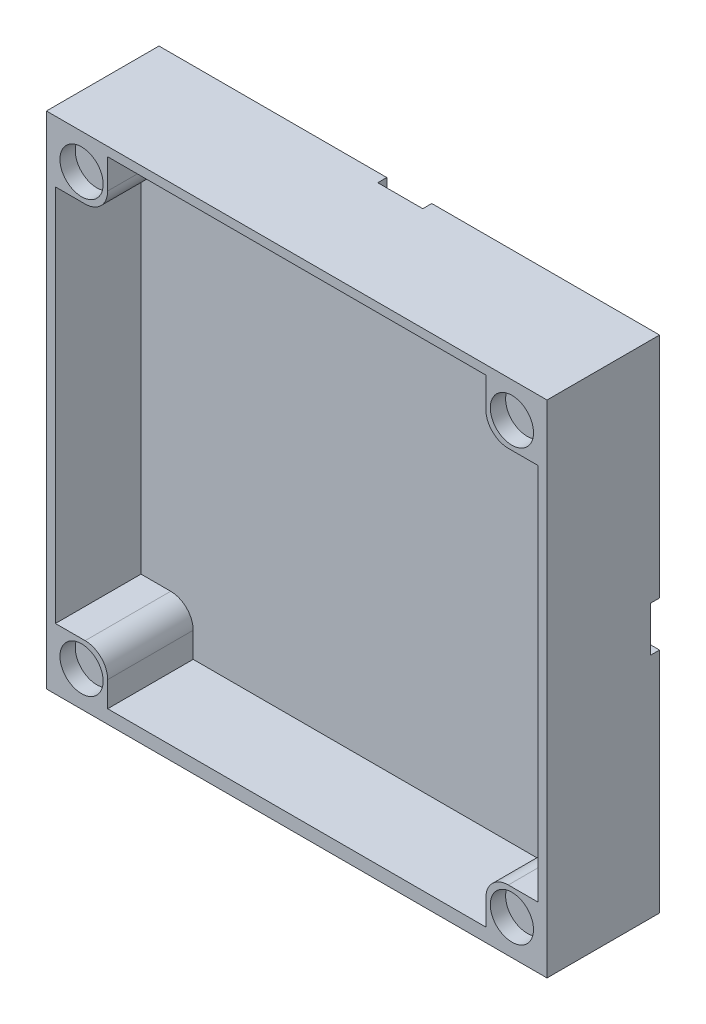
ISO-10303-21;
HEADER;
FILE_DESCRIPTION(('STEP AP214'),'2;1');
FILE_NAME('part.step','',(''),(''),'','','');
FILE_SCHEMA(('AUTOMOTIVE_DESIGN { 1 0 10303 214 1 1 1 1 }'));
ENDSEC;
DATA;
#1=APPLICATION_CONTEXT('core data for automotive mechanical design processes');
#2=APPLICATION_PROTOCOL_DEFINITION('international standard','automotive_design',2000,#1);
#3=PRODUCT_CONTEXT('',#1,'mechanical');
#4=PRODUCT('Part','Part','',(#3));
#5=PRODUCT_RELATED_PRODUCT_CATEGORY('part','',(#4));
#6=PRODUCT_DEFINITION_FORMATION('','',#4);
#7=PRODUCT_DEFINITION_CONTEXT('part definition',#1,'design');
#8=PRODUCT_DEFINITION('design','',#6,#7);
#9=PRODUCT_DEFINITION_SHAPE('','',#8);
#10=(LENGTH_UNIT() NAMED_UNIT(*) SI_UNIT(.MILLI.,.METRE.));
#11=(NAMED_UNIT(*) PLANE_ANGLE_UNIT() SI_UNIT($,.RADIAN.));
#12=(NAMED_UNIT(*) SI_UNIT($,.STERADIAN.) SOLID_ANGLE_UNIT());
#13=UNCERTAINTY_MEASURE_WITH_UNIT(LENGTH_MEASURE(1.E-05),#10,'distance_accuracy_value','');
#14=(GEOMETRIC_REPRESENTATION_CONTEXT(3) GLOBAL_UNCERTAINTY_ASSIGNED_CONTEXT((#13)) GLOBAL_UNIT_ASSIGNED_CONTEXT((#10,
#11,#12)) REPRESENTATION_CONTEXT('',''));
#15=CARTESIAN_POINT('',(0.,0.,0.));
#16=DIRECTION('',(0.,0.,1.));
#17=DIRECTION('',(1.,0.,0.));
#18=AXIS2_PLACEMENT_3D('',#15,#16,#17);
#19=CARTESIAN_POINT('',(27.8,27.8,3.));
#20=DIRECTION('',(1.,0.,0.));
#21=DIRECTION('',(0.,1.,0.));
#22=AXIS2_PLACEMENT_3D('',#19,#20,#21);
#23=PLANE('',#22);
#24=DIRECTION('',(0.,0.,-1.));
#25=VECTOR('',#24,1.);
#26=CARTESIAN_POINT('',(27.8,27.8,3.));
#27=LINE('',#26,#25);
#28=CARTESIAN_POINT('',(27.8,27.8,12.5));
#29=VERTEX_POINT('',#28);
#30=CARTESIAN_POINT('',(27.8,27.8,0.));
#31=VERTEX_POINT('',#30);
#32=EDGE_CURVE('E409',#29,#31,#27,.T.);
#33=ORIENTED_EDGE('',*,*,#32,.F.);
#34=DIRECTION('',(0.,1.,0.));
#35=VECTOR('',#34,1.);
#36=CARTESIAN_POINT('',(27.8,0.,12.5));
#37=LINE('',#36,#35);
#38=CARTESIAN_POINT('',(27.8,-27.8,12.5));
#39=VERTEX_POINT('',#38);
#40=EDGE_CURVE('E339',#39,#29,#37,.T.);
#41=ORIENTED_EDGE('',*,*,#40,.F.);
#42=DIRECTION('',(0.,0.,-1.));
#43=VECTOR('',#42,1.);
#44=CARTESIAN_POINT('',(27.8,-27.8,3.));
#45=LINE('',#44,#43);
#46=CARTESIAN_POINT('',(27.8,-27.8,0.));
#47=VERTEX_POINT('',#46);
#48=EDGE_CURVE('E405',#39,#47,#45,.T.);
#49=ORIENTED_EDGE('',*,*,#48,.T.);
#50=DIRECTION('',(0.,-1.,0.));
#51=VECTOR('',#50,1.);
#52=CARTESIAN_POINT('',(27.8,27.8,0.));
#53=LINE('',#52,#51);
#54=CARTESIAN_POINT('',(27.8,-2.49999999999999,0.));
#55=VERTEX_POINT('',#54);
#56=EDGE_CURVE('E401',#55,#47,#53,.T.);
#57=ORIENTED_EDGE('',*,*,#56,.F.);
#58=DIRECTION('',(0.,0.,-1.));
#59=VECTOR('',#58,1.);
#60=CARTESIAN_POINT('',(27.8,-2.49999999999999,1.));
#61=LINE('',#60,#59);
#62=CARTESIAN_POINT('',(27.8,-2.49999999999999,1.));
#63=VERTEX_POINT('',#62);
#64=EDGE_CURVE('E377',#63,#55,#61,.T.);
#65=ORIENTED_EDGE('',*,*,#64,.F.);
#66=DIRECTION('',(0.,-1.,0.));
#67=VECTOR('',#66,1.);
#68=CARTESIAN_POINT('',(27.8,2.50000000000001,1.));
#69=LINE('',#68,#67);
#70=CARTESIAN_POINT('',(27.8,2.50000000000001,1.));
#71=VERTEX_POINT('',#70);
#72=EDGE_CURVE('E366',#71,#63,#69,.T.);
#73=ORIENTED_EDGE('',*,*,#72,.F.);
#74=DIRECTION('',(0.,0.,-1.));
#75=VECTOR('',#74,1.);
#76=CARTESIAN_POINT('',(27.8,2.50000000000001,1.));
#77=LINE('',#76,#75);
#78=CARTESIAN_POINT('',(27.8,2.50000000000001,0.));
#79=VERTEX_POINT('',#78);
#80=EDGE_CURVE('E369',#71,#79,#77,.T.);
#81=ORIENTED_EDGE('',*,*,#80,.T.);
#82=EDGE_CURVE('E402',#31,#79,#53,.T.);
#83=ORIENTED_EDGE('',*,*,#82,.F.);
#84=EDGE_LOOP('',(#33,#41,#49,#57,#65,#73,#81,#83));
#85=FACE_BOUND('',#84,.T.);
#86=ADVANCED_FACE('F71',(#85),#23,.T.);
#87=CARTESIAN_POINT('',(27.8,27.8,3.));
#88=DIRECTION('',(0.,-1.,0.));
#89=DIRECTION('',(1.,0.,0.));
#90=AXIS2_PLACEMENT_3D('',#87,#88,#89);
#91=PLANE('',#90);
#92=DIRECTION('',(-1.,0.,0.));
#93=VECTOR('',#92,1.);
#94=CARTESIAN_POINT('',(27.8,27.8,0.));
#95=LINE('',#94,#93);
#96=CARTESIAN_POINT('',(-2.5,27.8,0.));
#97=VERTEX_POINT('',#96);
#98=CARTESIAN_POINT('',(-27.8,27.8,0.));
#99=VERTEX_POINT('',#98);
#100=EDGE_CURVE('E397',#97,#99,#95,.T.);
#101=ORIENTED_EDGE('',*,*,#100,.T.);
#102=DIRECTION('',(0.,0.,-1.));
#103=VECTOR('',#102,1.);
#104=CARTESIAN_POINT('',(-27.8,27.8,3.));
#105=LINE('',#104,#103);
#106=CARTESIAN_POINT('',(-27.8,27.8,12.5));
#107=VERTEX_POINT('',#106);
#108=EDGE_CURVE('E411',#107,#99,#105,.T.);
#109=ORIENTED_EDGE('',*,*,#108,.F.);
#110=DIRECTION('',(-1.,0.,0.));
#111=VECTOR('',#110,1.);
#112=CARTESIAN_POINT('',(0.,27.8,12.5));
#113=LINE('',#112,#111);
#114=EDGE_CURVE('E341',#29,#107,#113,.T.);
#115=ORIENTED_EDGE('',*,*,#114,.F.);
#116=ORIENTED_EDGE('',*,*,#32,.T.);
#117=CARTESIAN_POINT('',(2.5,27.8,0.));
#118=VERTEX_POINT('',#117);
#119=EDGE_CURVE('E398',#31,#118,#95,.T.);
#120=ORIENTED_EDGE('',*,*,#119,.T.);
#121=DIRECTION('',(0.,0.,-1.));
#122=VECTOR('',#121,1.);
#123=CARTESIAN_POINT('',(2.5,27.8,1.));
#124=LINE('',#123,#122);
#125=CARTESIAN_POINT('',(2.5,27.8,1.));
#126=VERTEX_POINT('',#125);
#127=EDGE_CURVE('E387',#126,#118,#124,.T.);
#128=ORIENTED_EDGE('',*,*,#127,.F.);
#129=DIRECTION('',(1.,0.,0.));
#130=VECTOR('',#129,1.);
#131=CARTESIAN_POINT('',(-2.5,27.8,1.));
#132=LINE('',#131,#130);
#133=CARTESIAN_POINT('',(-2.5,27.8,1.));
#134=VERTEX_POINT('',#133);
#135=EDGE_CURVE('E382',#134,#126,#132,.T.);
#136=ORIENTED_EDGE('',*,*,#135,.F.);
#137=DIRECTION('',(0.,0.,-1.));
#138=VECTOR('',#137,1.);
#139=CARTESIAN_POINT('',(-2.5,27.8,1.));
#140=LINE('',#139,#138);
#141=EDGE_CURVE('E373',#134,#97,#140,.T.);
#142=ORIENTED_EDGE('',*,*,#141,.T.);
#143=EDGE_LOOP('',(#101,#109,#115,#116,#120,#128,#136,#142));
#144=FACE_BOUND('',#143,.T.);
#145=ADVANCED_FACE('F496',(#144),#91,.F.);
#146=CARTESIAN_POINT('',(0.,0.,0.));
#147=DIRECTION('',(0.,0.,1.));
#148=DIRECTION('',(1.,0.,0.));
#149=AXIS2_PLACEMENT_3D('',#146,#147,#148);
#150=PLANE('',#149);
#151=DIRECTION('',(-1.,0.,0.));
#152=VECTOR('',#151,1.);
#153=CARTESIAN_POINT('',(27.8,2.50000000000001,0.));
#154=LINE('',#153,#152);
#155=CARTESIAN_POINT('',(17.5,2.50000000000001,0.));
#156=VERTEX_POINT('',#155);
#157=EDGE_CURVE('E360',#79,#156,#154,.T.);
#158=ORIENTED_EDGE('',*,*,#157,.T.);
#159=CARTESIAN_POINT('',(17.5,17.5,0.));
#160=DIRECTION('',(0.,0.,1.));
#161=DIRECTION('',(1.,0.,0.));
#162=AXIS2_PLACEMENT_3D('',#159,#160,#161);
#163=CIRCLE('',#162,15.);
#164=CARTESIAN_POINT('',(2.5,17.5,0.));
#165=VERTEX_POINT('',#164);
#166=EDGE_CURVE('E470',#156,#165,#163,.F.);
#167=ORIENTED_EDGE('',*,*,#166,.T.);
#168=DIRECTION('',(0.,1.,0.));
#169=VECTOR('',#168,1.);
#170=CARTESIAN_POINT('',(2.5,2.50000000000001,0.));
#171=LINE('',#170,#169);
#172=EDGE_CURVE('E346',#165,#118,#171,.T.);
#173=ORIENTED_EDGE('',*,*,#172,.T.);
#174=ORIENTED_EDGE('',*,*,#119,.F.);
#175=ORIENTED_EDGE('',*,*,#82,.T.);
#176=EDGE_LOOP('',(#158,#167,#173,#174,#175));
#177=FACE_BOUND('',#176,.T.);
#178=ADVANCED_FACE('F502',(#177),#150,.F.);
#179=CARTESIAN_POINT('',(27.8,-27.8,3.));
#180=DIRECTION('',(0.,-1.,0.));
#181=DIRECTION('',(1.,0.,0.));
#182=AXIS2_PLACEMENT_3D('',#179,#180,#181);
#183=PLANE('',#182);
#184=ORIENTED_EDGE('',*,*,#48,.F.);
#185=DIRECTION('',(1.,0.,0.));
#186=VECTOR('',#185,1.);
#187=CARTESIAN_POINT('',(0.,-27.8,12.5));
#188=LINE('',#187,#186);
#189=CARTESIAN_POINT('',(-27.8,-27.8,12.5));
#190=VERTEX_POINT('',#189);
#191=EDGE_CURVE('E337',#190,#39,#188,.T.);
#192=ORIENTED_EDGE('',*,*,#191,.F.);
#193=DIRECTION('',(0.,0.,-1.));
#194=VECTOR('',#193,1.);
#195=CARTESIAN_POINT('',(-27.8,-27.8,3.));
#196=LINE('',#195,#194);
#197=CARTESIAN_POINT('',(-27.8,-27.8,0.));
#198=VERTEX_POINT('',#197);
#199=EDGE_CURVE('E404',#190,#198,#196,.T.);
#200=ORIENTED_EDGE('',*,*,#199,.T.);
#201=DIRECTION('',(-1.,0.,0.));
#202=VECTOR('',#201,1.);
#203=CARTESIAN_POINT('',(27.8,-27.8,0.));
#204=LINE('',#203,#202);
#205=EDGE_CURVE('E379',#47,#198,#204,.T.);
#206=ORIENTED_EDGE('',*,*,#205,.F.);
#207=EDGE_LOOP('',(#184,#192,#200,#206));
#208=FACE_BOUND('',#207,.T.);
#209=ADVANCED_FACE('F513',(#208),#183,.T.);
#210=CARTESIAN_POINT('',(-27.8,27.8,3.));
#211=DIRECTION('',(1.,0.,0.));
#212=DIRECTION('',(0.,1.,0.));
#213=AXIS2_PLACEMENT_3D('',#210,#211,#212);
#214=PLANE('',#213);
#215=DIRECTION('',(0.,-1.,0.));
#216=VECTOR('',#215,1.);
#217=CARTESIAN_POINT('',(-27.8,27.8,0.));
#218=LINE('',#217,#216);
#219=EDGE_CURVE('E394',#99,#198,#218,.T.);
#220=ORIENTED_EDGE('',*,*,#219,.T.);
#221=ORIENTED_EDGE('',*,*,#199,.F.);
#222=DIRECTION('',(0.,-1.,0.));
#223=VECTOR('',#222,1.);
#224=CARTESIAN_POINT('',(-27.8,0.,12.5));
#225=LINE('',#224,#223);
#226=EDGE_CURVE('E343',#107,#190,#225,.T.);
#227=ORIENTED_EDGE('',*,*,#226,.F.);
#228=ORIENTED_EDGE('',*,*,#108,.T.);
#229=EDGE_LOOP('',(#220,#221,#227,#228));
#230=FACE_BOUND('',#229,.T.);
#231=ADVANCED_FACE('F510',(#230),#214,.F.);
#232=ORIENTED_EDGE('',*,*,#205,.T.);
#233=ORIENTED_EDGE('',*,*,#219,.F.);
#234=ORIENTED_EDGE('',*,*,#100,.F.);
#235=DIRECTION('',(0.,-1.,0.));
#236=VECTOR('',#235,1.);
#237=CARTESIAN_POINT('',(-2.5,2.50000000000001,0.));
#238=LINE('',#237,#236);
#239=CARTESIAN_POINT('',(-2.5,17.5,0.));
#240=VERTEX_POINT('',#239);
#241=EDGE_CURVE('E372',#97,#240,#238,.T.);
#242=ORIENTED_EDGE('',*,*,#241,.T.);
#243=CARTESIAN_POINT('',(17.5,17.5,0.));
#244=DIRECTION('',(0.,0.,1.));
#245=DIRECTION('',(1.,0.,0.));
#246=AXIS2_PLACEMENT_3D('',#243,#244,#245);
#247=CIRCLE('',#246,20.);
#248=CARTESIAN_POINT('',(17.5,-2.49999999999999,0.));
#249=VERTEX_POINT('',#248);
#250=EDGE_CURVE('E12',#240,#249,#247,.T.);
#251=ORIENTED_EDGE('',*,*,#250,.T.);
#252=DIRECTION('',(-1.,0.,0.));
#253=VECTOR('',#252,1.);
#254=CARTESIAN_POINT('',(27.8,-2.49999999999999,0.));
#255=LINE('',#254,#253);
#256=EDGE_CURVE('E370',#55,#249,#255,.T.);
#257=ORIENTED_EDGE('',*,*,#256,.F.);
#258=ORIENTED_EDGE('',*,*,#56,.T.);
#259=EDGE_LOOP('',(#232,#233,#234,#242,#251,#257,#258));
#260=FACE_BOUND('',#259,.T.);
#261=ADVANCED_FACE('F507',(#260),#150,.F.);
#262=CARTESIAN_POINT('',(27.8,2.50000000000001,1.));
#263=DIRECTION('',(0.,-1.,0.));
#264=DIRECTION('',(0.,0.,-1.));
#265=AXIS2_PLACEMENT_3D('',#262,#263,#264);
#266=PLANE('',#265);
#267=DIRECTION('',(-1.,0.,0.));
#268=VECTOR('',#267,1.);
#269=CARTESIAN_POINT('',(27.8,2.50000000000001,1.));
#270=LINE('',#269,#268);
#271=CARTESIAN_POINT('',(17.5,2.50000000000001,1.));
#272=VERTEX_POINT('',#271);
#273=EDGE_CURVE('E363',#71,#272,#270,.T.);
#274=ORIENTED_EDGE('',*,*,#273,.T.);
#275=DIRECTION('',(0.,0.,-1.));
#276=VECTOR('',#275,1.);
#277=CARTESIAN_POINT('',(17.5,2.50000000000001,1.));
#278=LINE('',#277,#276);
#279=EDGE_CURVE('E467',#272,#156,#278,.T.);
#280=ORIENTED_EDGE('',*,*,#279,.T.);
#281=ORIENTED_EDGE('',*,*,#157,.F.);
#282=ORIENTED_EDGE('',*,*,#80,.F.);
#283=EDGE_LOOP('',(#274,#280,#281,#282));
#284=FACE_BOUND('',#283,.T.);
#285=ADVANCED_FACE('F635',(#284),#266,.T.);
#286=CARTESIAN_POINT('',(27.8,-2.49999999999999,1.));
#287=DIRECTION('',(0.,-1.,0.));
#288=DIRECTION('',(0.,0.,-1.));
#289=AXIS2_PLACEMENT_3D('',#286,#287,#288);
#290=PLANE('',#289);
#291=ORIENTED_EDGE('',*,*,#256,.T.);
#292=DIRECTION('',(0.,0.,-1.));
#293=VECTOR('',#292,1.);
#294=CARTESIAN_POINT('',(17.5,-2.49999999999999,1.));
#295=LINE('',#294,#293);
#296=CARTESIAN_POINT('',(17.5,-2.49999999999999,1.));
#297=VERTEX_POINT('',#296);
#298=EDGE_CURVE('E86',#249,#297,#295,.F.);
#299=ORIENTED_EDGE('',*,*,#298,.T.);
#300=DIRECTION('',(-1.,0.,0.));
#301=VECTOR('',#300,1.);
#302=CARTESIAN_POINT('',(27.8,-2.49999999999999,1.));
#303=LINE('',#302,#301);
#304=EDGE_CURVE('E357',#63,#297,#303,.T.);
#305=ORIENTED_EDGE('',*,*,#304,.F.);
#306=ORIENTED_EDGE('',*,*,#64,.T.);
#307=EDGE_LOOP('',(#291,#299,#305,#306));
#308=FACE_BOUND('',#307,.T.);
#309=ADVANCED_FACE('F638',(#308),#290,.F.);
#310=CARTESIAN_POINT('',(-2.5,2.50000000000001,1.));
#311=DIRECTION('',(1.,0.,0.));
#312=DIRECTION('',(0.,0.,-1.));
#313=AXIS2_PLACEMENT_3D('',#310,#311,#312);
#314=PLANE('',#313);
#315=DIRECTION('',(0.,-1.,0.));
#316=VECTOR('',#315,1.);
#317=CARTESIAN_POINT('',(-2.5,2.50000000000001,1.));
#318=LINE('',#317,#316);
#319=CARTESIAN_POINT('',(-2.5,17.5,1.));
#320=VERTEX_POINT('',#319);
#321=EDGE_CURVE('E359',#134,#320,#318,.T.);
#322=ORIENTED_EDGE('',*,*,#321,.T.);
#323=DIRECTION('',(0.,0.,-1.));
#324=VECTOR('',#323,1.);
#325=CARTESIAN_POINT('',(-2.5,17.5,1.));
#326=LINE('',#325,#324);
#327=EDGE_CURVE('E476',#320,#240,#326,.T.);
#328=ORIENTED_EDGE('',*,*,#327,.T.);
#329=ORIENTED_EDGE('',*,*,#241,.F.);
#330=ORIENTED_EDGE('',*,*,#141,.F.);
#331=EDGE_LOOP('',(#322,#328,#329,#330));
#332=FACE_BOUND('',#331,.T.);
#333=ADVANCED_FACE('F486',(#332),#314,.T.);
#334=CARTESIAN_POINT('',(0.,0.,1.));
#335=DIRECTION('',(0.,0.,1.));
#336=DIRECTION('',(1.,0.,0.));
#337=AXIS2_PLACEMENT_3D('',#334,#335,#336);
#338=PLANE('',#337);
#339=CARTESIAN_POINT('',(20.8,0.,1.));
#340=DIRECTION('',(0.,0.,-1.));
#341=DIRECTION('',(-1.,0.,0.));
#342=AXIS2_PLACEMENT_3D('',#339,#340,#341);
#343=CIRCLE('',#342,2.);
#344=CARTESIAN_POINT('',(18.8,0.,1.));
#345=VERTEX_POINT('',#344);
#346=EDGE_CURVE('E326',#345,#345,#343,.T.);
#347=ORIENTED_EDGE('',*,*,#346,.F.);
#348=EDGE_LOOP('',(#347));
#349=FACE_BOUND('',#348,.T.);
#350=CARTESIAN_POINT('',(0.,20.8,1.));
#351=DIRECTION('',(0.,0.,-1.));
#352=DIRECTION('',(-1.,0.,0.));
#353=AXIS2_PLACEMENT_3D('',#350,#351,#352);
#354=CIRCLE('',#353,2.);
#355=CARTESIAN_POINT('',(-2.,20.8,1.));
#356=VERTEX_POINT('',#355);
#357=EDGE_CURVE('E325',#356,#356,#354,.T.);
#358=ORIENTED_EDGE('',*,*,#357,.F.);
#359=EDGE_LOOP('',(#358));
#360=FACE_BOUND('',#359,.T.);
#361=ORIENTED_EDGE('',*,*,#304,.T.);
#362=CARTESIAN_POINT('',(17.5,17.5,1.));
#363=DIRECTION('',(0.,0.,1.));
#364=DIRECTION('',(1.,0.,0.));
#365=AXIS2_PLACEMENT_3D('',#362,#363,#364);
#366=CIRCLE('',#365,20.);
#367=EDGE_CURVE('E79',#297,#320,#366,.F.);
#368=ORIENTED_EDGE('',*,*,#367,.T.);
#369=ORIENTED_EDGE('',*,*,#321,.F.);
#370=ORIENTED_EDGE('',*,*,#135,.T.);
#371=DIRECTION('',(0.,1.,0.));
#372=VECTOR('',#371,1.);
#373=CARTESIAN_POINT('',(2.5,2.50000000000001,1.));
#374=LINE('',#373,#372);
#375=CARTESIAN_POINT('',(2.5,17.5,1.));
#376=VERTEX_POINT('',#375);
#377=EDGE_CURVE('E385',#376,#126,#374,.T.);
#378=ORIENTED_EDGE('',*,*,#377,.F.);
#379=CARTESIAN_POINT('',(17.5,17.5,1.));
#380=DIRECTION('',(0.,0.,1.));
#381=DIRECTION('',(1.,0.,0.));
#382=AXIS2_PLACEMENT_3D('',#379,#380,#381);
#383=CIRCLE('',#382,15.);
#384=EDGE_CURVE('E474',#376,#272,#383,.T.);
#385=ORIENTED_EDGE('',*,*,#384,.T.);
#386=ORIENTED_EDGE('',*,*,#273,.F.);
#387=ORIENTED_EDGE('',*,*,#72,.T.);
#388=EDGE_LOOP('',(#361,#368,#369,#370,#378,#385,#386,#387));
#389=FACE_BOUND('',#388,.T.);
#390=ADVANCED_FACE('F481',(#349,#360,#389),#338,.F.);
#391=CARTESIAN_POINT('',(2.5,2.50000000000001,1.));
#392=DIRECTION('',(-1.,0.,0.));
#393=DIRECTION('',(0.,0.,1.));
#394=AXIS2_PLACEMENT_3D('',#391,#392,#393);
#395=PLANE('',#394);
#396=ORIENTED_EDGE('',*,*,#172,.F.);
#397=DIRECTION('',(0.,0.,-1.));
#398=VECTOR('',#397,1.);
#399=CARTESIAN_POINT('',(2.5,17.5,1.));
#400=LINE('',#399,#398);
#401=EDGE_CURVE('E472',#165,#376,#400,.F.);
#402=ORIENTED_EDGE('',*,*,#401,.T.);
#403=ORIENTED_EDGE('',*,*,#377,.T.);
#404=ORIENTED_EDGE('',*,*,#127,.T.);
#405=EDGE_LOOP('',(#396,#402,#403,#404));
#406=FACE_BOUND('',#405,.T.);
#407=ADVANCED_FACE('F627',(#406),#395,.T.);
#408=CARTESIAN_POINT('',(26.8,0.,12.5));
#409=DIRECTION('',(1.,0.,0.));
#410=DIRECTION('',(0.,1.,0.));
#411=AXIS2_PLACEMENT_3D('',#408,#409,#410);
#412=PLANE('',#411);
#413=DIRECTION('',(0.,-1.,0.));
#414=VECTOR('',#413,1.);
#415=CARTESIAN_POINT('',(26.8,0.,3.));
#416=LINE('',#415,#414);
#417=CARTESIAN_POINT('',(26.8,21.,3.));
#418=VERTEX_POINT('',#417);
#419=CARTESIAN_POINT('',(26.8,-21.,3.));
#420=VERTEX_POINT('',#419);
#421=EDGE_CURVE('E279',#418,#420,#416,.T.);
#422=ORIENTED_EDGE('',*,*,#421,.T.);
#423=DIRECTION('',(0.,0.,1.));
#424=VECTOR('',#423,1.);
#425=CARTESIAN_POINT('',(26.8,-21.,12.5));
#426=LINE('',#425,#424);
#427=CARTESIAN_POINT('',(26.8,-21.,12.5));
#428=VERTEX_POINT('',#427);
#429=EDGE_CURVE('E301',#420,#428,#426,.T.);
#430=ORIENTED_EDGE('',*,*,#429,.T.);
#431=DIRECTION('',(0.,-1.,0.));
#432=VECTOR('',#431,1.);
#433=CARTESIAN_POINT('',(26.8,0.,12.5));
#434=LINE('',#433,#432);
#435=CARTESIAN_POINT('',(26.8,21.,12.5));
#436=VERTEX_POINT('',#435);
#437=EDGE_CURVE('E334',#436,#428,#434,.T.);
#438=ORIENTED_EDGE('',*,*,#437,.F.);
#439=DIRECTION('',(0.,0.,-1.));
#440=VECTOR('',#439,1.);
#441=CARTESIAN_POINT('',(26.8,21.,12.5));
#442=LINE('',#441,#440);
#443=EDGE_CURVE('E319',#436,#418,#442,.T.);
#444=ORIENTED_EDGE('',*,*,#443,.T.);
#445=EDGE_LOOP('',(#422,#430,#438,#444));
#446=FACE_BOUND('',#445,.T.);
#447=ADVANCED_FACE('F565',(#446),#412,.F.);
#448=CARTESIAN_POINT('',(-26.8,0.,12.5));
#449=DIRECTION('',(1.,0.,0.));
#450=DIRECTION('',(0.,1.,0.));
#451=AXIS2_PLACEMENT_3D('',#448,#449,#450);
#452=PLANE('',#451);
#453=DIRECTION('',(0.,0.,1.));
#454=VECTOR('',#453,1.);
#455=CARTESIAN_POINT('',(-26.8,-21.,12.5));
#456=LINE('',#455,#454);
#457=CARTESIAN_POINT('',(-26.8,-21.,3.));
#458=VERTEX_POINT('',#457);
#459=CARTESIAN_POINT('',(-26.8,-21.,12.5));
#460=VERTEX_POINT('',#459);
#461=EDGE_CURVE('E261',#458,#460,#456,.T.);
#462=ORIENTED_EDGE('',*,*,#461,.F.);
#463=DIRECTION('',(0.,-1.,0.));
#464=VECTOR('',#463,1.);
#465=CARTESIAN_POINT('',(-26.8,0.,3.));
#466=LINE('',#465,#464);
#467=CARTESIAN_POINT('',(-26.8,21.,3.));
#468=VERTEX_POINT('',#467);
#469=EDGE_CURVE('E270',#468,#458,#466,.T.);
#470=ORIENTED_EDGE('',*,*,#469,.F.);
#471=DIRECTION('',(0.,0.,-1.));
#472=VECTOR('',#471,1.);
#473=CARTESIAN_POINT('',(-26.8,21.,12.5));
#474=LINE('',#473,#472);
#475=CARTESIAN_POINT('',(-26.8,21.,12.5));
#476=VERTEX_POINT('',#475);
#477=EDGE_CURVE('E312',#476,#468,#474,.T.);
#478=ORIENTED_EDGE('',*,*,#477,.F.);
#479=DIRECTION('',(0.,-1.,0.));
#480=VECTOR('',#479,1.);
#481=CARTESIAN_POINT('',(-26.8,0.,12.5));
#482=LINE('',#481,#480);
#483=EDGE_CURVE('E283',#476,#460,#482,.T.);
#484=ORIENTED_EDGE('',*,*,#483,.T.);
#485=EDGE_LOOP('',(#462,#470,#478,#484));
#486=FACE_BOUND('',#485,.T.);
#487=ADVANCED_FACE('F281',(#486),#452,.T.);
#488=CARTESIAN_POINT('',(0.,26.8,12.5));
#489=DIRECTION('',(0.,1.,0.));
#490=DIRECTION('',(0.,0.,1.));
#491=AXIS2_PLACEMENT_3D('',#488,#489,#490);
#492=PLANE('',#491);
#493=DIRECTION('',(1.,0.,0.));
#494=VECTOR('',#493,1.);
#495=CARTESIAN_POINT('',(0.,26.8,12.5));
#496=LINE('',#495,#494);
#497=CARTESIAN_POINT('',(-21.,26.8,12.5));
#498=VERTEX_POINT('',#497);
#499=CARTESIAN_POINT('',(21.,26.8,12.5));
#500=VERTEX_POINT('',#499);
#501=EDGE_CURVE('E278',#498,#500,#496,.T.);
#502=ORIENTED_EDGE('',*,*,#501,.F.);
#503=DIRECTION('',(0.,0.,-1.));
#504=VECTOR('',#503,1.);
#505=CARTESIAN_POINT('',(-21.,26.8,12.5));
#506=LINE('',#505,#504);
#507=CARTESIAN_POINT('',(-21.,26.8,3.));
#508=VERTEX_POINT('',#507);
#509=EDGE_CURVE('E309',#498,#508,#506,.T.);
#510=ORIENTED_EDGE('',*,*,#509,.T.);
#511=DIRECTION('',(1.,0.,0.));
#512=VECTOR('',#511,1.);
#513=CARTESIAN_POINT('',(0.,26.8,3.));
#514=LINE('',#513,#512);
#515=CARTESIAN_POINT('',(21.,26.8,3.));
#516=VERTEX_POINT('',#515);
#517=EDGE_CURVE('E347',#508,#516,#514,.T.);
#518=ORIENTED_EDGE('',*,*,#517,.T.);
#519=DIRECTION('',(0.,0.,1.));
#520=VECTOR('',#519,1.);
#521=CARTESIAN_POINT('',(21.,26.8,12.5));
#522=LINE('',#521,#520);
#523=EDGE_CURVE('E322',#516,#500,#522,.T.);
#524=ORIENTED_EDGE('',*,*,#523,.T.);
#525=EDGE_LOOP('',(#502,#510,#518,#524));
#526=FACE_BOUND('',#525,.T.);
#527=ADVANCED_FACE('F550',(#526),#492,.F.);
#528=CARTESIAN_POINT('',(0.,0.,12.5));
#529=DIRECTION('',(0.,0.,1.));
#530=DIRECTION('',(1.,0.,0.));
#531=AXIS2_PLACEMENT_3D('',#528,#529,#530);
#532=PLANE('',#531);
#533=CARTESIAN_POINT('',(23.9002805646626,-23.9,12.5));
#534=DIRECTION('',(0.,0.,1.));
#535=DIRECTION('',(1.,0.,0.));
#536=AXIS2_PLACEMENT_3D('',#533,#534,#535);
#537=CIRCLE('',#536,2.4);
#538=CARTESIAN_POINT('',(26.3002805646626,-23.9,12.5));
#539=VERTEX_POINT('',#538);
#540=EDGE_CURVE('E983',#539,#539,#537,.T.);
#541=ORIENTED_EDGE('',*,*,#540,.F.);
#542=EDGE_LOOP('',(#541));
#543=FACE_BOUND('',#542,.T.);
#544=CARTESIAN_POINT('',(23.9002805646626,23.9,12.5));
#545=DIRECTION('',(0.,0.,1.));
#546=DIRECTION('',(1.,0.,0.));
#547=AXIS2_PLACEMENT_3D('',#544,#545,#546);
#548=CIRCLE('',#547,2.4);
#549=CARTESIAN_POINT('',(26.3002805646626,23.9,12.5));
#550=VERTEX_POINT('',#549);
#551=EDGE_CURVE('E982',#550,#550,#548,.T.);
#552=ORIENTED_EDGE('',*,*,#551,.F.);
#553=EDGE_LOOP('',(#552));
#554=FACE_BOUND('',#553,.T.);
#555=CARTESIAN_POINT('',(-23.9,23.9,12.5));
#556=DIRECTION('',(0.,0.,1.));
#557=DIRECTION('',(1.,0.,0.));
#558=AXIS2_PLACEMENT_3D('',#555,#556,#557);
#559=CIRCLE('',#558,2.4);
#560=CARTESIAN_POINT('',(-21.5,23.9,12.5));
#561=VERTEX_POINT('',#560);
#562=EDGE_CURVE('E1001',#561,#561,#559,.T.);
#563=ORIENTED_EDGE('',*,*,#562,.F.);
#564=EDGE_LOOP('',(#563));
#565=FACE_BOUND('',#564,.T.);
#566=CARTESIAN_POINT('',(-23.9,-23.9,12.5));
#567=DIRECTION('',(0.,0.,1.));
#568=DIRECTION('',(1.,0.,0.));
#569=AXIS2_PLACEMENT_3D('',#566,#567,#568);
#570=CIRCLE('',#569,2.4);
#571=CARTESIAN_POINT('',(-21.5,-23.9,12.5));
#572=VERTEX_POINT('',#571);
#573=EDGE_CURVE('E995',#572,#572,#570,.T.);
#574=ORIENTED_EDGE('',*,*,#573,.F.);
#575=EDGE_LOOP('',(#574));
#576=FACE_BOUND('',#575,.T.);
#577=DIRECTION('',(0.,1.,0.));
#578=VECTOR('',#577,1.);
#579=CARTESIAN_POINT('',(21.,27.8,12.5));
#580=LINE('',#579,#578);
#581=CARTESIAN_POINT('',(21.,23.5,12.5));
#582=VERTEX_POINT('',#581);
#583=EDGE_CURVE('E317',#582,#500,#580,.T.);
#584=ORIENTED_EDGE('',*,*,#583,.F.);
#585=CARTESIAN_POINT('',(23.5,23.5,12.5));
#586=DIRECTION('',(0.,0.,1.));
#587=DIRECTION('',(1.,0.,0.));
#588=AXIS2_PLACEMENT_3D('',#585,#586,#587);
#589=CIRCLE('',#588,2.5);
#590=CARTESIAN_POINT('',(23.5,21.,12.5));
#591=VERTEX_POINT('',#590);
#592=EDGE_CURVE('E444',#582,#591,#589,.T.);
#593=ORIENTED_EDGE('',*,*,#592,.T.);
#594=DIRECTION('',(-1.,0.,0.));
#595=VECTOR('',#594,1.);
#596=CARTESIAN_POINT('',(27.8,21.,12.5));
#597=LINE('',#596,#595);
#598=EDGE_CURVE('E314',#436,#591,#597,.T.);
#599=ORIENTED_EDGE('',*,*,#598,.F.);
#600=ORIENTED_EDGE('',*,*,#437,.T.);
#601=DIRECTION('',(1.,0.,0.));
#602=VECTOR('',#601,1.);
#603=CARTESIAN_POINT('',(27.8,-21.,12.5));
#604=LINE('',#603,#602);
#605=CARTESIAN_POINT('',(23.5,-21.,12.5));
#606=VERTEX_POINT('',#605);
#607=EDGE_CURVE('E296',#606,#428,#604,.T.);
#608=ORIENTED_EDGE('',*,*,#607,.F.);
#609=CARTESIAN_POINT('',(23.5,-23.5,12.5));
#610=DIRECTION('',(0.,0.,1.));
#611=DIRECTION('',(1.,0.,0.));
#612=AXIS2_PLACEMENT_3D('',#609,#610,#611);
#613=CIRCLE('',#612,2.5);
#614=CARTESIAN_POINT('',(21.,-23.5,12.5));
#615=VERTEX_POINT('',#614);
#616=EDGE_CURVE('E442',#606,#615,#613,.T.);
#617=ORIENTED_EDGE('',*,*,#616,.T.);
#618=DIRECTION('',(0.,1.,0.));
#619=VECTOR('',#618,1.);
#620=CARTESIAN_POINT('',(21.,-27.8,12.5));
#621=LINE('',#620,#619);
#622=CARTESIAN_POINT('',(21.,-26.3,12.5));
#623=VERTEX_POINT('',#622);
#624=EDGE_CURVE('E288',#623,#615,#621,.T.);
#625=ORIENTED_EDGE('',*,*,#624,.F.);
#626=DIRECTION('',(1.,0.,0.));
#627=VECTOR('',#626,1.);
#628=CARTESIAN_POINT('',(-26.8,-26.3,12.5));
#629=LINE('',#628,#627);
#630=CARTESIAN_POINT('',(-21.,-26.3,12.5));
#631=VERTEX_POINT('',#630);
#632=EDGE_CURVE('E349',#631,#623,#629,.T.);
#633=ORIENTED_EDGE('',*,*,#632,.F.);
#634=DIRECTION('',(0.,-1.,0.));
#635=VECTOR('',#634,1.);
#636=CARTESIAN_POINT('',(-21.,-27.8,12.5));
#637=LINE('',#636,#635);
#638=CARTESIAN_POINT('',(-21.,-23.5,12.5));
#639=VERTEX_POINT('',#638);
#640=EDGE_CURVE('E285',#639,#631,#637,.T.);
#641=ORIENTED_EDGE('',*,*,#640,.F.);
#642=CARTESIAN_POINT('',(-23.5,-23.5,12.5));
#643=DIRECTION('',(0.,0.,1.));
#644=DIRECTION('',(1.,0.,0.));
#645=AXIS2_PLACEMENT_3D('',#642,#643,#644);
#646=CIRCLE('',#645,2.5);
#647=CARTESIAN_POINT('',(-23.5,-21.,12.5));
#648=VERTEX_POINT('',#647);
#649=EDGE_CURVE('E440',#639,#648,#646,.T.);
#650=ORIENTED_EDGE('',*,*,#649,.T.);
#651=DIRECTION('',(1.,0.,0.));
#652=VECTOR('',#651,1.);
#653=CARTESIAN_POINT('',(-27.8,-21.,12.5));
#654=LINE('',#653,#652);
#655=EDGE_CURVE('E290',#460,#648,#654,.T.);
#656=ORIENTED_EDGE('',*,*,#655,.F.);
#657=ORIENTED_EDGE('',*,*,#483,.F.);
#658=DIRECTION('',(-1.,0.,0.));
#659=VECTOR('',#658,1.);
#660=CARTESIAN_POINT('',(-27.8,21.,12.5));
#661=LINE('',#660,#659);
#662=CARTESIAN_POINT('',(-23.5,21.,12.5));
#663=VERTEX_POINT('',#662);
#664=EDGE_CURVE('E307',#663,#476,#661,.T.);
#665=ORIENTED_EDGE('',*,*,#664,.F.);
#666=CARTESIAN_POINT('',(-23.5,23.5,12.5));
#667=DIRECTION('',(0.,0.,1.));
#668=DIRECTION('',(1.,0.,0.));
#669=AXIS2_PLACEMENT_3D('',#666,#667,#668);
#670=CIRCLE('',#669,2.5);
#671=CARTESIAN_POINT('',(-21.,23.5,12.5));
#672=VERTEX_POINT('',#671);
#673=EDGE_CURVE('E438',#663,#672,#670,.T.);
#674=ORIENTED_EDGE('',*,*,#673,.T.);
#675=DIRECTION('',(0.,-1.,0.));
#676=VECTOR('',#675,1.);
#677=CARTESIAN_POINT('',(-21.,27.8,12.5));
#678=LINE('',#677,#676);
#679=EDGE_CURVE('E304',#498,#672,#678,.T.);
#680=ORIENTED_EDGE('',*,*,#679,.F.);
#681=ORIENTED_EDGE('',*,*,#501,.T.);
#682=EDGE_LOOP('',(#584,#593,#599,#600,#608,#617,#625,#633,#641,#650,#656,#657,#665,#674,#680,#681));
#683=FACE_BOUND('',#682,.T.);
#684=ORIENTED_EDGE('',*,*,#191,.T.);
#685=ORIENTED_EDGE('',*,*,#40,.T.);
#686=ORIENTED_EDGE('',*,*,#114,.T.);
#687=ORIENTED_EDGE('',*,*,#226,.T.);
#688=EDGE_LOOP('',(#684,#685,#686,#687));
#689=FACE_BOUND('',#688,.T.);
#690=ADVANCED_FACE('F542',(#543,#554,#565,#576,#683,#689),#532,.T.);
#691=CARTESIAN_POINT('',(-26.8,-26.3,12.5));
#692=DIRECTION('',(0.,1.,0.));
#693=DIRECTION('',(0.,0.,1.));
#694=AXIS2_PLACEMENT_3D('',#691,#692,#693);
#695=PLANE('',#694);
#696=DIRECTION('',(0.,0.,-1.));
#697=VECTOR('',#696,1.);
#698=CARTESIAN_POINT('',(-21.,-26.3,12.5));
#699=LINE('',#698,#697);
#700=CARTESIAN_POINT('',(-21.,-26.3,3.));
#701=VERTEX_POINT('',#700);
#702=EDGE_CURVE('E284',#631,#701,#699,.T.);
#703=ORIENTED_EDGE('',*,*,#702,.F.);
#704=ORIENTED_EDGE('',*,*,#632,.T.);
#705=DIRECTION('',(0.,0.,1.));
#706=VECTOR('',#705,1.);
#707=CARTESIAN_POINT('',(21.,-26.3,12.5));
#708=LINE('',#707,#706);
#709=CARTESIAN_POINT('',(21.,-26.3,3.));
#710=VERTEX_POINT('',#709);
#711=EDGE_CURVE('E298',#710,#623,#708,.T.);
#712=ORIENTED_EDGE('',*,*,#711,.F.);
#713=DIRECTION('',(1.,0.,0.));
#714=VECTOR('',#713,1.);
#715=CARTESIAN_POINT('',(-26.8,-26.3,3.));
#716=LINE('',#715,#714);
#717=EDGE_CURVE('E353',#701,#710,#716,.T.);
#718=ORIENTED_EDGE('',*,*,#717,.F.);
#719=EDGE_LOOP('',(#703,#704,#712,#718));
#720=FACE_BOUND('',#719,.T.);
#721=ADVANCED_FACE('F579',(#720),#695,.T.);
#722=CARTESIAN_POINT('',(0.,0.,3.));
#723=DIRECTION('',(0.,0.,1.));
#724=DIRECTION('',(1.,0.,0.));
#725=AXIS2_PLACEMENT_3D('',#722,#723,#724);
#726=PLANE('',#725);
#727=DIRECTION('',(0.,1.,0.));
#728=VECTOR('',#727,1.);
#729=CARTESIAN_POINT('',(-21.,0.,3.));
#730=LINE('',#729,#728);
#731=CARTESIAN_POINT('',(-21.,-23.5,3.));
#732=VERTEX_POINT('',#731);
#733=EDGE_CURVE('E266',#701,#732,#730,.T.);
#734=ORIENTED_EDGE('',*,*,#733,.F.);
#735=ORIENTED_EDGE('',*,*,#717,.T.);
#736=DIRECTION('',(0.,-1.,0.));
#737=VECTOR('',#736,1.);
#738=CARTESIAN_POINT('',(21.,0.,3.));
#739=LINE('',#738,#737);
#740=CARTESIAN_POINT('',(21.,-23.5,3.));
#741=VERTEX_POINT('',#740);
#742=EDGE_CURVE('E427',#741,#710,#739,.T.);
#743=ORIENTED_EDGE('',*,*,#742,.F.);
#744=CARTESIAN_POINT('',(23.5,-23.5,3.));
#745=DIRECTION('',(0.,0.,1.));
#746=DIRECTION('',(1.,0.,0.));
#747=AXIS2_PLACEMENT_3D('',#744,#745,#746);
#748=CIRCLE('',#747,2.5);
#749=CARTESIAN_POINT('',(23.5,-21.,3.));
#750=VERTEX_POINT('',#749);
#751=EDGE_CURVE('E461',#741,#750,#748,.F.);
#752=ORIENTED_EDGE('',*,*,#751,.T.);
#753=DIRECTION('',(-1.,0.,0.));
#754=VECTOR('',#753,1.);
#755=CARTESIAN_POINT('',(0.,-21.,3.));
#756=LINE('',#755,#754);
#757=EDGE_CURVE('E267',#420,#750,#756,.T.);
#758=ORIENTED_EDGE('',*,*,#757,.F.);
#759=ORIENTED_EDGE('',*,*,#421,.F.);
#760=DIRECTION('',(1.,0.,0.));
#761=VECTOR('',#760,1.);
#762=CARTESIAN_POINT('',(0.,21.,3.));
#763=LINE('',#762,#761);
#764=CARTESIAN_POINT('',(23.5,21.,3.));
#765=VERTEX_POINT('',#764);
#766=EDGE_CURVE('E408',#765,#418,#763,.T.);
#767=ORIENTED_EDGE('',*,*,#766,.F.);
#768=CARTESIAN_POINT('',(23.5,23.5,3.));
#769=DIRECTION('',(0.,0.,1.));
#770=DIRECTION('',(1.,0.,0.));
#771=AXIS2_PLACEMENT_3D('',#768,#769,#770);
#772=CIRCLE('',#771,2.5);
#773=CARTESIAN_POINT('',(21.,23.5,3.));
#774=VERTEX_POINT('',#773);
#775=EDGE_CURVE('E459',#765,#774,#772,.F.);
#776=ORIENTED_EDGE('',*,*,#775,.T.);
#777=DIRECTION('',(0.,-1.,0.));
#778=VECTOR('',#777,1.);
#779=CARTESIAN_POINT('',(21.,0.,3.));
#780=LINE('',#779,#778);
#781=EDGE_CURVE('E421',#516,#774,#780,.T.);
#782=ORIENTED_EDGE('',*,*,#781,.F.);
#783=ORIENTED_EDGE('',*,*,#517,.F.);
#784=DIRECTION('',(0.,1.,0.));
#785=VECTOR('',#784,1.);
#786=CARTESIAN_POINT('',(-21.,0.,3.));
#787=LINE('',#786,#785);
#788=CARTESIAN_POINT('',(-21.,23.5,3.));
#789=VERTEX_POINT('',#788);
#790=EDGE_CURVE('E424',#789,#508,#787,.T.);
#791=ORIENTED_EDGE('',*,*,#790,.F.);
#792=CARTESIAN_POINT('',(-23.5,23.5,3.));
#793=DIRECTION('',(0.,0.,1.));
#794=DIRECTION('',(1.,0.,0.));
#795=AXIS2_PLACEMENT_3D('',#792,#793,#794);
#796=CIRCLE('',#795,2.5);
#797=CARTESIAN_POINT('',(-23.5,21.,3.));
#798=VERTEX_POINT('',#797);
#799=EDGE_CURVE('E465',#789,#798,#796,.F.);
#800=ORIENTED_EDGE('',*,*,#799,.T.);
#801=DIRECTION('',(1.,0.,0.));
#802=VECTOR('',#801,1.);
#803=CARTESIAN_POINT('',(0.,21.,3.));
#804=LINE('',#803,#802);
#805=EDGE_CURVE('E274',#468,#798,#804,.T.);
#806=ORIENTED_EDGE('',*,*,#805,.F.);
#807=ORIENTED_EDGE('',*,*,#469,.T.);
#808=DIRECTION('',(-1.,0.,0.));
#809=VECTOR('',#808,1.);
#810=CARTESIAN_POINT('',(0.,-21.,3.));
#811=LINE('',#810,#809);
#812=CARTESIAN_POINT('',(-23.5,-21.,3.));
#813=VERTEX_POINT('',#812);
#814=EDGE_CURVE('E256',#813,#458,#811,.T.);
#815=ORIENTED_EDGE('',*,*,#814,.F.);
#816=CARTESIAN_POINT('',(-23.5,-23.5,3.));
#817=DIRECTION('',(0.,0.,1.));
#818=DIRECTION('',(1.,0.,0.));
#819=AXIS2_PLACEMENT_3D('',#816,#817,#818);
#820=CIRCLE('',#819,2.5);
#821=EDGE_CURVE('E463',#813,#732,#820,.F.);
#822=ORIENTED_EDGE('',*,*,#821,.T.);
#823=EDGE_LOOP('',(#734,#735,#743,#752,#758,#759,#767,#776,#782,#783,#791,#800,#806,#807,#815,#822));
#824=FACE_BOUND('',#823,.T.);
#825=CARTESIAN_POINT('',(20.8,0.,3.));
#826=DIRECTION('',(0.,0.,1.));
#827=DIRECTION('',(1.,0.,0.));
#828=AXIS2_PLACEMENT_3D('',#825,#826,#827);
#829=CIRCLE('',#828,2.);
#830=CARTESIAN_POINT('',(22.8,0.,3.));
#831=VERTEX_POINT('',#830);
#832=EDGE_CURVE('E356',#831,#831,#829,.T.);
#833=ORIENTED_EDGE('',*,*,#832,.F.);
#834=EDGE_LOOP('',(#833));
#835=FACE_BOUND('',#834,.T.);
#836=CARTESIAN_POINT('',(0.,20.8,3.));
#837=DIRECTION('',(0.,0.,1.));
#838=DIRECTION('',(1.,0.,0.));
#839=AXIS2_PLACEMENT_3D('',#836,#837,#838);
#840=CIRCLE('',#839,2.);
#841=CARTESIAN_POINT('',(2.00000000000001,20.8,3.));
#842=VERTEX_POINT('',#841);
#843=EDGE_CURVE('E329',#842,#842,#840,.T.);
#844=ORIENTED_EDGE('',*,*,#843,.F.);
#845=EDGE_LOOP('',(#844));
#846=FACE_BOUND('',#845,.T.);
#847=ADVANCED_FACE('F271',(#824,#835,#846),#726,.T.);
#848=CARTESIAN_POINT('',(0.,20.8,5.));
#849=DIRECTION('',(0.,0.,-1.));
#850=DIRECTION('',(-1.,0.,0.));
#851=AXIS2_PLACEMENT_3D('',#848,#849,#850);
#852=CYLINDRICAL_SURFACE('',#851,2.);
#853=ORIENTED_EDGE('',*,*,#843,.T.);
#854=EDGE_LOOP('',(#853));
#855=FACE_BOUND('',#854,.T.);
#856=ORIENTED_EDGE('',*,*,#357,.T.);
#857=EDGE_LOOP('',(#856));
#858=FACE_BOUND('',#857,.T.);
#859=ADVANCED_FACE('F615',(#855,#858),#852,.F.);
#860=CARTESIAN_POINT('',(20.8,0.,5.));
#861=DIRECTION('',(0.,0.,-1.));
#862=DIRECTION('',(-1.,0.,0.));
#863=AXIS2_PLACEMENT_3D('',#860,#861,#862);
#864=CYLINDRICAL_SURFACE('',#863,2.);
#865=ORIENTED_EDGE('',*,*,#832,.T.);
#866=EDGE_LOOP('',(#865));
#867=FACE_BOUND('',#866,.T.);
#868=ORIENTED_EDGE('',*,*,#346,.T.);
#869=EDGE_LOOP('',(#868));
#870=FACE_BOUND('',#869,.T.);
#871=ADVANCED_FACE('F610',(#867,#870),#864,.F.);
#872=CARTESIAN_POINT('',(21.,27.8,12.5));
#873=DIRECTION('',(-1.,0.,0.));
#874=DIRECTION('',(0.,0.,1.));
#875=AXIS2_PLACEMENT_3D('',#872,#873,#874);
#876=PLANE('',#875);
#877=ORIENTED_EDGE('',*,*,#781,.T.);
#878=DIRECTION('',(0.,0.,-1.));
#879=VECTOR('',#878,1.);
#880=CARTESIAN_POINT('',(21.,23.5,12.5));
#881=LINE('',#880,#879);
#882=EDGE_CURVE('E436',#774,#582,#881,.F.);
#883=ORIENTED_EDGE('',*,*,#882,.T.);
#884=ORIENTED_EDGE('',*,*,#583,.T.);
#885=ORIENTED_EDGE('',*,*,#523,.F.);
#886=EDGE_LOOP('',(#877,#883,#884,#885));
#887=FACE_BOUND('',#886,.T.);
#888=ADVANCED_FACE('F607',(#887),#876,.T.);
#889=CARTESIAN_POINT('',(27.8,21.,12.5));
#890=DIRECTION('',(0.,-1.,0.));
#891=DIRECTION('',(0.,0.,-1.));
#892=AXIS2_PLACEMENT_3D('',#889,#890,#891);
#893=PLANE('',#892);
#894=ORIENTED_EDGE('',*,*,#598,.T.);
#895=DIRECTION('',(0.,0.,-1.));
#896=VECTOR('',#895,1.);
#897=CARTESIAN_POINT('',(23.5,21.,12.5));
#898=LINE('',#897,#896);
#899=EDGE_CURVE('E433',#591,#765,#898,.T.);
#900=ORIENTED_EDGE('',*,*,#899,.T.);
#901=ORIENTED_EDGE('',*,*,#766,.T.);
#902=ORIENTED_EDGE('',*,*,#443,.F.);
#903=EDGE_LOOP('',(#894,#900,#901,#902));
#904=FACE_BOUND('',#903,.T.);
#905=ADVANCED_FACE('F560',(#904),#893,.T.);
#906=CARTESIAN_POINT('',(-21.,27.8,12.5));
#907=DIRECTION('',(1.,0.,0.));
#908=DIRECTION('',(0.,0.,-1.));
#909=AXIS2_PLACEMENT_3D('',#906,#907,#908);
#910=PLANE('',#909);
#911=ORIENTED_EDGE('',*,*,#679,.T.);
#912=DIRECTION('',(0.,0.,-1.));
#913=VECTOR('',#912,1.);
#914=CARTESIAN_POINT('',(-21.,23.5,12.5));
#915=LINE('',#914,#913);
#916=EDGE_CURVE('E454',#672,#789,#915,.T.);
#917=ORIENTED_EDGE('',*,*,#916,.T.);
#918=ORIENTED_EDGE('',*,*,#790,.T.);
#919=ORIENTED_EDGE('',*,*,#509,.F.);
#920=EDGE_LOOP('',(#911,#917,#918,#919));
#921=FACE_BOUND('',#920,.T.);
#922=ADVANCED_FACE('F546',(#921),#910,.T.);
#923=CARTESIAN_POINT('',(-27.8,21.,12.5));
#924=DIRECTION('',(0.,-1.,0.));
#925=DIRECTION('',(0.,0.,-1.));
#926=AXIS2_PLACEMENT_3D('',#923,#924,#925);
#927=PLANE('',#926);
#928=ORIENTED_EDGE('',*,*,#805,.T.);
#929=DIRECTION('',(0.,0.,-1.));
#930=VECTOR('',#929,1.);
#931=CARTESIAN_POINT('',(-23.5,21.,12.5));
#932=LINE('',#931,#930);
#933=EDGE_CURVE('E457',#798,#663,#932,.F.);
#934=ORIENTED_EDGE('',*,*,#933,.T.);
#935=ORIENTED_EDGE('',*,*,#664,.T.);
#936=ORIENTED_EDGE('',*,*,#477,.T.);
#937=EDGE_LOOP('',(#928,#934,#935,#936));
#938=FACE_BOUND('',#937,.T.);
#939=ADVANCED_FACE('F600',(#938),#927,.T.);
#940=CARTESIAN_POINT('',(27.8,-21.,12.5));
#941=DIRECTION('',(0.,1.,0.));
#942=DIRECTION('',(0.,0.,1.));
#943=AXIS2_PLACEMENT_3D('',#940,#941,#942);
#944=PLANE('',#943);
#945=ORIENTED_EDGE('',*,*,#757,.T.);
#946=DIRECTION('',(0.,0.,-1.));
#947=VECTOR('',#946,1.);
#948=CARTESIAN_POINT('',(23.5,-21.,12.5));
#949=LINE('',#948,#947);
#950=EDGE_CURVE('E449',#750,#606,#949,.F.);
#951=ORIENTED_EDGE('',*,*,#950,.T.);
#952=ORIENTED_EDGE('',*,*,#607,.T.);
#953=ORIENTED_EDGE('',*,*,#429,.F.);
#954=EDGE_LOOP('',(#945,#951,#952,#953));
#955=FACE_BOUND('',#954,.T.);
#956=ADVANCED_FACE('F594',(#955),#944,.T.);
#957=CARTESIAN_POINT('',(21.,-27.8,12.5));
#958=DIRECTION('',(-1.,0.,0.));
#959=DIRECTION('',(0.,0.,1.));
#960=AXIS2_PLACEMENT_3D('',#957,#958,#959);
#961=PLANE('',#960);
#962=ORIENTED_EDGE('',*,*,#624,.T.);
#963=DIRECTION('',(0.,0.,-1.));
#964=VECTOR('',#963,1.);
#965=CARTESIAN_POINT('',(21.,-23.5,12.5));
#966=LINE('',#965,#964);
#967=EDGE_CURVE('E446',#615,#741,#966,.T.);
#968=ORIENTED_EDGE('',*,*,#967,.T.);
#969=ORIENTED_EDGE('',*,*,#742,.T.);
#970=ORIENTED_EDGE('',*,*,#711,.T.);
#971=EDGE_LOOP('',(#962,#968,#969,#970));
#972=FACE_BOUND('',#971,.T.);
#973=ADVANCED_FACE('F574',(#972),#961,.T.);
#974=CARTESIAN_POINT('',(-21.,-27.8,12.5));
#975=DIRECTION('',(1.,0.,0.));
#976=DIRECTION('',(0.,0.,-1.));
#977=AXIS2_PLACEMENT_3D('',#974,#975,#976);
#978=PLANE('',#977);
#979=ORIENTED_EDGE('',*,*,#733,.T.);
#980=DIRECTION('',(0.,0.,-1.));
#981=VECTOR('',#980,1.);
#982=CARTESIAN_POINT('',(-21.,-23.5,12.5));
#983=LINE('',#982,#981);
#984=EDGE_CURVE('E452',#732,#639,#983,.F.);
#985=ORIENTED_EDGE('',*,*,#984,.T.);
#986=ORIENTED_EDGE('',*,*,#640,.T.);
#987=ORIENTED_EDGE('',*,*,#702,.T.);
#988=EDGE_LOOP('',(#979,#985,#986,#987));
#989=FACE_BOUND('',#988,.T.);
#990=ADVANCED_FACE('F585',(#989),#978,.T.);
#991=CARTESIAN_POINT('',(-27.8,-21.,12.5));
#992=DIRECTION('',(0.,1.,0.));
#993=DIRECTION('',(0.,0.,1.));
#994=AXIS2_PLACEMENT_3D('',#991,#992,#993);
#995=PLANE('',#994);
#996=ORIENTED_EDGE('',*,*,#655,.T.);
#997=DIRECTION('',(0.,0.,-1.));
#998=VECTOR('',#997,1.);
#999=CARTESIAN_POINT('',(-23.5,-21.,12.5));
#1000=LINE('',#999,#998);
#1001=EDGE_CURVE('E264',#648,#813,#1000,.T.);
#1002=ORIENTED_EDGE('',*,*,#1001,.T.);
#1003=ORIENTED_EDGE('',*,*,#814,.T.);
#1004=ORIENTED_EDGE('',*,*,#461,.T.);
#1005=EDGE_LOOP('',(#996,#1002,#1003,#1004));
#1006=FACE_BOUND('',#1005,.T.);
#1007=ADVANCED_FACE('F259',(#1006),#995,.T.);
#1008=CARTESIAN_POINT('',(-23.9,-23.9,10.8));
#1009=DIRECTION('',(0.,0.,1.));
#1010=DIRECTION('',(1.,0.,0.));
#1011=AXIS2_PLACEMENT_3D('',#1008,#1009,#1010);
#1012=CYLINDRICAL_SURFACE('',#1011,2.4);
#1013=CARTESIAN_POINT('',(-23.9,-23.9,10.8));
#1014=DIRECTION('',(0.,0.,1.));
#1015=DIRECTION('',(1.,0.,0.));
#1016=AXIS2_PLACEMENT_3D('',#1013,#1014,#1015);
#1017=CIRCLE('',#1016,2.4);
#1018=CARTESIAN_POINT('',(-21.5,-23.9,10.8));
#1019=VERTEX_POINT('',#1018);
#1020=EDGE_CURVE('E992',#1019,#1019,#1017,.T.);
#1021=ORIENTED_EDGE('',*,*,#1020,.F.);
#1022=EDGE_LOOP('',(#1021));
#1023=FACE_BOUND('',#1022,.T.);
#1024=ORIENTED_EDGE('',*,*,#573,.T.);
#1025=EDGE_LOOP('',(#1024));
#1026=FACE_BOUND('',#1025,.T.);
#1027=ADVANCED_FACE('F592',(#1023,#1026),#1012,.F.);
#1028=CARTESIAN_POINT('',(-23.9,-23.9,10.8));
#1029=DIRECTION('',(0.,0.,1.));
#1030=DIRECTION('',(1.,0.,0.));
#1031=AXIS2_PLACEMENT_3D('',#1028,#1029,#1030);
#1032=PLANE('',#1031);
#1033=ORIENTED_EDGE('',*,*,#1020,.T.);
#1034=EDGE_LOOP('',(#1033));
#1035=FACE_BOUND('',#1034,.T.);
#1036=ADVANCED_FACE('F887',(#1035),#1032,.T.);
#1037=CARTESIAN_POINT('',(-23.9,23.9,10.8));
#1038=DIRECTION('',(0.,0.,1.));
#1039=DIRECTION('',(1.,0.,0.));
#1040=AXIS2_PLACEMENT_3D('',#1037,#1038,#1039);
#1041=CYLINDRICAL_SURFACE('',#1040,2.4);
#1042=CARTESIAN_POINT('',(-23.9,23.9,10.8));
#1043=DIRECTION('',(0.,0.,1.));
#1044=DIRECTION('',(1.,0.,0.));
#1045=AXIS2_PLACEMENT_3D('',#1042,#1043,#1044);
#1046=CIRCLE('',#1045,2.4);
#1047=CARTESIAN_POINT('',(-21.5,23.9,10.8));
#1048=VERTEX_POINT('',#1047);
#1049=EDGE_CURVE('E997',#1048,#1048,#1046,.T.);
#1050=ORIENTED_EDGE('',*,*,#1049,.F.);
#1051=EDGE_LOOP('',(#1050));
#1052=FACE_BOUND('',#1051,.T.);
#1053=ORIENTED_EDGE('',*,*,#562,.T.);
#1054=EDGE_LOOP('',(#1053));
#1055=FACE_BOUND('',#1054,.T.);
#1056=ADVANCED_FACE('F896',(#1052,#1055),#1041,.F.);
#1057=CARTESIAN_POINT('',(-23.9,23.9,10.8));
#1058=DIRECTION('',(0.,0.,1.));
#1059=DIRECTION('',(1.,0.,0.));
#1060=AXIS2_PLACEMENT_3D('',#1057,#1058,#1059);
#1061=PLANE('',#1060);
#1062=ORIENTED_EDGE('',*,*,#1049,.T.);
#1063=EDGE_LOOP('',(#1062));
#1064=FACE_BOUND('',#1063,.T.);
#1065=ADVANCED_FACE('F905',(#1064),#1061,.T.);
#1066=CARTESIAN_POINT('',(23.9002805646626,23.9,10.8));
#1067=DIRECTION('',(0.,0.,1.));
#1068=DIRECTION('',(1.,0.,0.));
#1069=AXIS2_PLACEMENT_3D('',#1066,#1067,#1068);
#1070=CYLINDRICAL_SURFACE('',#1069,2.4);
#1071=CARTESIAN_POINT('',(23.9002805646626,23.9,10.8));
#1072=DIRECTION('',(0.,0.,1.));
#1073=DIRECTION('',(1.,0.,0.));
#1074=AXIS2_PLACEMENT_3D('',#1071,#1072,#1073);
#1075=CIRCLE('',#1074,2.4);
#1076=CARTESIAN_POINT('',(26.3002805646626,23.9,10.8));
#1077=VERTEX_POINT('',#1076);
#1078=EDGE_CURVE('E986',#1077,#1077,#1075,.T.);
#1079=ORIENTED_EDGE('',*,*,#1078,.F.);
#1080=EDGE_LOOP('',(#1079));
#1081=FACE_BOUND('',#1080,.T.);
#1082=ORIENTED_EDGE('',*,*,#551,.T.);
#1083=EDGE_LOOP('',(#1082));
#1084=FACE_BOUND('',#1083,.T.);
#1085=ADVANCED_FACE('F915',(#1081,#1084),#1070,.F.);
#1086=CARTESIAN_POINT('',(23.9002805646626,23.9,10.8));
#1087=DIRECTION('',(0.,0.,1.));
#1088=DIRECTION('',(1.,0.,0.));
#1089=AXIS2_PLACEMENT_3D('',#1086,#1087,#1088);
#1090=PLANE('',#1089);
#1091=ORIENTED_EDGE('',*,*,#1078,.T.);
#1092=EDGE_LOOP('',(#1091));
#1093=FACE_BOUND('',#1092,.T.);
#1094=ADVANCED_FACE('F925',(#1093),#1090,.T.);
#1095=CARTESIAN_POINT('',(23.9002805646626,-23.9,10.8));
#1096=DIRECTION('',(0.,0.,1.));
#1097=DIRECTION('',(1.,0.,0.));
#1098=AXIS2_PLACEMENT_3D('',#1095,#1096,#1097);
#1099=CYLINDRICAL_SURFACE('',#1098,2.4);
#1100=CARTESIAN_POINT('',(23.9002805646626,-23.9,10.8));
#1101=DIRECTION('',(0.,0.,1.));
#1102=DIRECTION('',(1.,0.,0.));
#1103=AXIS2_PLACEMENT_3D('',#1100,#1101,#1102);
#1104=CIRCLE('',#1103,2.4);
#1105=CARTESIAN_POINT('',(26.3002805646626,-23.9,10.8));
#1106=VERTEX_POINT('',#1105);
#1107=EDGE_CURVE('E981',#1106,#1106,#1104,.T.);
#1108=ORIENTED_EDGE('',*,*,#1107,.F.);
#1109=EDGE_LOOP('',(#1108));
#1110=FACE_BOUND('',#1109,.T.);
#1111=ORIENTED_EDGE('',*,*,#540,.T.);
#1112=EDGE_LOOP('',(#1111));
#1113=FACE_BOUND('',#1112,.T.);
#1114=ADVANCED_FACE('F935',(#1110,#1113),#1099,.F.);
#1115=CARTESIAN_POINT('',(23.9002805646626,-23.9,10.8));
#1116=DIRECTION('',(0.,0.,1.));
#1117=DIRECTION('',(1.,0.,0.));
#1118=AXIS2_PLACEMENT_3D('',#1115,#1116,#1117);
#1119=PLANE('',#1118);
#1120=ORIENTED_EDGE('',*,*,#1107,.T.);
#1121=EDGE_LOOP('',(#1120));
#1122=FACE_BOUND('',#1121,.T.);
#1123=ADVANCED_FACE('F522',(#1122),#1119,.T.);
#1124=CARTESIAN_POINT('',(23.5,23.5,12.5));
#1125=DIRECTION('',(0.,0.,-1.));
#1126=DIRECTION('',(-1.,0.,0.));
#1127=AXIS2_PLACEMENT_3D('',#1124,#1125,#1126);
#1128=CYLINDRICAL_SURFACE('',#1127,2.5);
#1129=ORIENTED_EDGE('',*,*,#592,.F.);
#1130=ORIENTED_EDGE('',*,*,#882,.F.);
#1131=ORIENTED_EDGE('',*,*,#775,.F.);
#1132=ORIENTED_EDGE('',*,*,#899,.F.);
#1133=EDGE_LOOP('',(#1129,#1130,#1131,#1132));
#1134=FACE_BOUND('',#1133,.T.);
#1135=ADVANCED_FACE('F518',(#1134),#1128,.T.);
#1136=CARTESIAN_POINT('',(23.5,-23.5,12.5));
#1137=DIRECTION('',(0.,0.,-1.));
#1138=DIRECTION('',(-1.,0.,0.));
#1139=AXIS2_PLACEMENT_3D('',#1136,#1137,#1138);
#1140=CYLINDRICAL_SURFACE('',#1139,2.5);
#1141=ORIENTED_EDGE('',*,*,#616,.F.);
#1142=ORIENTED_EDGE('',*,*,#950,.F.);
#1143=ORIENTED_EDGE('',*,*,#751,.F.);
#1144=ORIENTED_EDGE('',*,*,#967,.F.);
#1145=EDGE_LOOP('',(#1141,#1142,#1143,#1144));
#1146=FACE_BOUND('',#1145,.T.);
#1147=ADVANCED_FACE('F521',(#1146),#1140,.T.);
#1148=CARTESIAN_POINT('',(-23.5,-23.5,12.5));
#1149=DIRECTION('',(0.,0.,-1.));
#1150=DIRECTION('',(-1.,0.,0.));
#1151=AXIS2_PLACEMENT_3D('',#1148,#1149,#1150);
#1152=CYLINDRICAL_SURFACE('',#1151,2.5);
#1153=ORIENTED_EDGE('',*,*,#649,.F.);
#1154=ORIENTED_EDGE('',*,*,#984,.F.);
#1155=ORIENTED_EDGE('',*,*,#821,.F.);
#1156=ORIENTED_EDGE('',*,*,#1001,.F.);
#1157=EDGE_LOOP('',(#1153,#1154,#1155,#1156));
#1158=FACE_BOUND('',#1157,.T.);
#1159=ADVANCED_FACE('F526',(#1158),#1152,.T.);
#1160=CARTESIAN_POINT('',(-23.5,23.5,12.5));
#1161=DIRECTION('',(0.,0.,-1.));
#1162=DIRECTION('',(-1.,0.,0.));
#1163=AXIS2_PLACEMENT_3D('',#1160,#1161,#1162);
#1164=CYLINDRICAL_SURFACE('',#1163,2.5);
#1165=ORIENTED_EDGE('',*,*,#673,.F.);
#1166=ORIENTED_EDGE('',*,*,#933,.F.);
#1167=ORIENTED_EDGE('',*,*,#799,.F.);
#1168=ORIENTED_EDGE('',*,*,#916,.F.);
#1169=EDGE_LOOP('',(#1165,#1166,#1167,#1168));
#1170=FACE_BOUND('',#1169,.T.);
#1171=ADVANCED_FACE('F493',(#1170),#1164,.T.);
#1172=CARTESIAN_POINT('',(17.5,17.5,1.));
#1173=DIRECTION('',(0.,0.,-1.));
#1174=DIRECTION('',(-1.,0.,0.));
#1175=AXIS2_PLACEMENT_3D('',#1172,#1173,#1174);
#1176=CYLINDRICAL_SURFACE('',#1175,15.);
#1177=ORIENTED_EDGE('',*,*,#384,.F.);
#1178=ORIENTED_EDGE('',*,*,#401,.F.);
#1179=ORIENTED_EDGE('',*,*,#166,.F.);
#1180=ORIENTED_EDGE('',*,*,#279,.F.);
#1181=EDGE_LOOP('',(#1177,#1178,#1179,#1180));
#1182=FACE_BOUND('',#1181,.T.);
#1183=ADVANCED_FACE('F489',(#1182),#1176,.T.);
#1184=CARTESIAN_POINT('',(17.5,17.5,1.));
#1185=DIRECTION('',(0.,0.,-1.));
#1186=DIRECTION('',(-1.,0.,0.));
#1187=AXIS2_PLACEMENT_3D('',#1184,#1185,#1186);
#1188=CYLINDRICAL_SURFACE('',#1187,20.);
#1189=ORIENTED_EDGE('',*,*,#367,.F.);
#1190=ORIENTED_EDGE('',*,*,#298,.F.);
#1191=ORIENTED_EDGE('',*,*,#250,.F.);
#1192=ORIENTED_EDGE('',*,*,#327,.F.);
#1193=EDGE_LOOP('',(#1189,#1190,#1191,#1192));
#1194=FACE_BOUND('',#1193,.T.);
#1195=ADVANCED_FACE('F73',(#1194),#1188,.F.);
#1196=CLOSED_SHELL('',(#86,#145,#178,#209,#231,#261,#285,#309,#333,#390,#407,#447,#487,#527,
#690,#721,#847,#859,#871,#888,#905,#922,#939,#956,#973,#990,#1007,#1027,#1036,#1056,#1065,#1085,
#1094,#1114,#1123,#1135,#1147,#1159,#1171,#1183,#1195));
#1197=MANIFOLD_SOLID_BREP('B2',#1196);
#1198=ADVANCED_BREP_SHAPE_REPRESENTATION('',(#18,#1197),#14);
#1199=SHAPE_DEFINITION_REPRESENTATION(#9,#1198);
ENDSEC;
END-ISO-10303-21;
